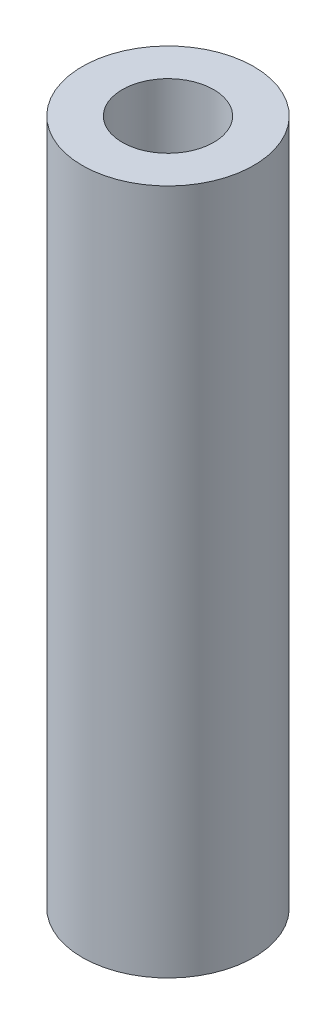
ISO-10303-21;
HEADER;
FILE_DESCRIPTION(('STEP AP214'),'2;1');
FILE_NAME('part.step','',(''),(''),'','','');
FILE_SCHEMA(('AUTOMOTIVE_DESIGN { 1 0 10303 214 1 1 1 1 }'));
ENDSEC;
DATA;
#1=APPLICATION_CONTEXT('core data for automotive mechanical design processes');
#2=APPLICATION_PROTOCOL_DEFINITION('international standard','automotive_design',2000,#1);
#3=PRODUCT_CONTEXT('',#1,'mechanical');
#4=PRODUCT('Part','Part','',(#3));
#5=PRODUCT_RELATED_PRODUCT_CATEGORY('part','',(#4));
#6=PRODUCT_DEFINITION_FORMATION('','',#4);
#7=PRODUCT_DEFINITION_CONTEXT('part definition',#1,'design');
#8=PRODUCT_DEFINITION('design','',#6,#7);
#9=PRODUCT_DEFINITION_SHAPE('','',#8);
#10=(LENGTH_UNIT() NAMED_UNIT(*) SI_UNIT(.MILLI.,.METRE.));
#11=(NAMED_UNIT(*) PLANE_ANGLE_UNIT() SI_UNIT($,.RADIAN.));
#12=(NAMED_UNIT(*) SI_UNIT($,.STERADIAN.) SOLID_ANGLE_UNIT());
#13=UNCERTAINTY_MEASURE_WITH_UNIT(LENGTH_MEASURE(1.E-05),#10,'distance_accuracy_value','');
#14=(GEOMETRIC_REPRESENTATION_CONTEXT(3) GLOBAL_UNCERTAINTY_ASSIGNED_CONTEXT((#13)) GLOBAL_UNIT_ASSIGNED_CONTEXT((#10,
#11,#12)) REPRESENTATION_CONTEXT('',''));
#15=CARTESIAN_POINT('',(0.,0.,0.));
#16=DIRECTION('',(0.,0.,1.));
#17=DIRECTION('',(1.,0.,0.));
#18=AXIS2_PLACEMENT_3D('',#15,#16,#17);
#19=CARTESIAN_POINT('',(0.,0.,0.));
#20=DIRECTION('',(0.,-1.,0.));
#21=DIRECTION('',(0.,0.,-1.));
#22=AXIS2_PLACEMENT_3D('',#19,#20,#21);
#23=CYLINDRICAL_SURFACE('',#22,8.);
#24=CARTESIAN_POINT('',(0.,0.,0.));
#25=DIRECTION('',(0.,-1.,0.));
#26=DIRECTION('',(0.,0.,-1.));
#27=AXIS2_PLACEMENT_3D('',#24,#25,#26);
#28=CIRCLE('',#27,8.);
#29=CARTESIAN_POINT('',(0.,0.,-8.));
#30=VERTEX_POINT('',#29);
#31=EDGE_CURVE('E53',#30,#30,#28,.T.);
#32=ORIENTED_EDGE('',*,*,#31,.T.);
#33=EDGE_LOOP('',(#32));
#34=FACE_BOUND('',#33,.T.);
#35=CARTESIAN_POINT('',(0.,120.,0.));
#36=DIRECTION('',(0.,-1.,0.));
#37=DIRECTION('',(0.,0.,-1.));
#38=AXIS2_PLACEMENT_3D('',#35,#36,#37);
#39=CIRCLE('',#38,8.);
#40=CARTESIAN_POINT('',(0.,120.,-8.));
#41=VERTEX_POINT('',#40);
#42=EDGE_CURVE('E10',#41,#41,#39,.T.);
#43=ORIENTED_EDGE('',*,*,#42,.F.);
#44=EDGE_LOOP('',(#43));
#45=FACE_BOUND('',#44,.T.);
#46=ADVANCED_FACE('F39',(#34,#45),#23,.F.);
#47=CARTESIAN_POINT('',(0.,120.,-8.));
#48=DIRECTION('',(0.,1.,0.));
#49=DIRECTION('',(0.,0.,1.));
#50=AXIS2_PLACEMENT_3D('',#47,#48,#49);
#51=PLANE('',#50);
#52=ORIENTED_EDGE('',*,*,#42,.T.);
#53=EDGE_LOOP('',(#52));
#54=FACE_BOUND('',#53,.T.);
#55=CARTESIAN_POINT('',(0.,120.,0.));
#56=DIRECTION('',(0.,-1.,0.));
#57=DIRECTION('',(0.,0.,-1.));
#58=AXIS2_PLACEMENT_3D('',#55,#56,#57);
#59=CIRCLE('',#58,15.);
#60=CARTESIAN_POINT('',(0.,120.,-15.));
#61=VERTEX_POINT('',#60);
#62=EDGE_CURVE('E45',#61,#61,#59,.T.);
#63=ORIENTED_EDGE('',*,*,#62,.F.);
#64=EDGE_LOOP('',(#63));
#65=FACE_BOUND('',#64,.T.);
#66=ADVANCED_FACE('F69',(#54,#65),#51,.T.);
#67=CARTESIAN_POINT('',(0.,0.,0.));
#68=DIRECTION('',(0.,-1.,0.));
#69=DIRECTION('',(0.,0.,-1.));
#70=AXIS2_PLACEMENT_3D('',#67,#68,#69);
#71=CYLINDRICAL_SURFACE('',#70,15.);
#72=ORIENTED_EDGE('',*,*,#62,.T.);
#73=EDGE_LOOP('',(#72));
#74=FACE_BOUND('',#73,.T.);
#75=CARTESIAN_POINT('',(0.,0.,0.));
#76=DIRECTION('',(0.,-1.,0.));
#77=DIRECTION('',(0.,0.,-1.));
#78=AXIS2_PLACEMENT_3D('',#75,#76,#77);
#79=CIRCLE('',#78,15.);
#80=CARTESIAN_POINT('',(0.,0.,-15.));
#81=VERTEX_POINT('',#80);
#82=EDGE_CURVE('E49',#81,#81,#79,.T.);
#83=ORIENTED_EDGE('',*,*,#82,.F.);
#84=EDGE_LOOP('',(#83));
#85=FACE_BOUND('',#84,.T.);
#86=ADVANCED_FACE('F63',(#74,#85),#71,.T.);
#87=CARTESIAN_POINT('',(0.,0.,-8.));
#88=DIRECTION('',(0.,-1.,0.));
#89=DIRECTION('',(0.,0.,-1.));
#90=AXIS2_PLACEMENT_3D('',#87,#88,#89);
#91=PLANE('',#90);
#92=ORIENTED_EDGE('',*,*,#82,.T.);
#93=EDGE_LOOP('',(#92));
#94=FACE_BOUND('',#93,.T.);
#95=ORIENTED_EDGE('',*,*,#31,.F.);
#96=EDGE_LOOP('',(#95));
#97=FACE_BOUND('',#96,.T.);
#98=ADVANCED_FACE('F61',(#94,#97),#91,.T.);
#99=CLOSED_SHELL('',(#46,#66,#86,#98));
#100=MANIFOLD_SOLID_BREP('B2',#99);
#101=ADVANCED_BREP_SHAPE_REPRESENTATION('',(#18,#100),#14);
#102=SHAPE_DEFINITION_REPRESENTATION(#9,#101);
ENDSEC;
END-ISO-10303-21;
